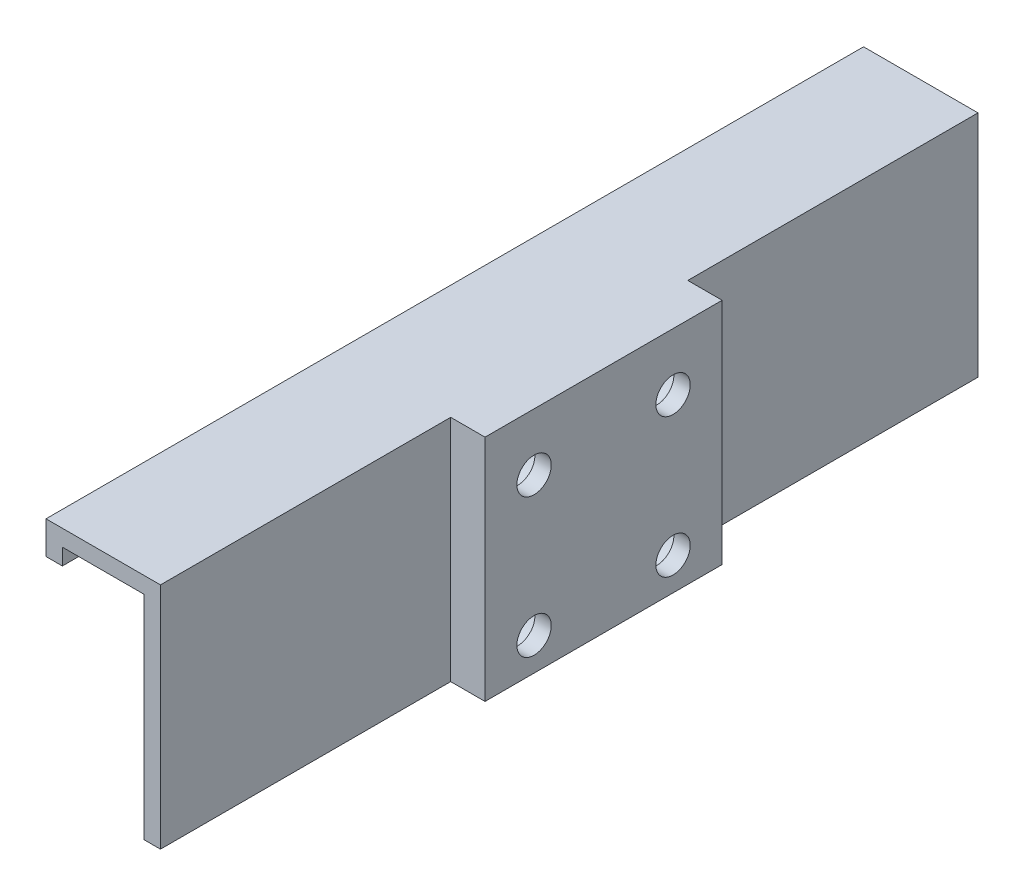
ISO-10303-21;
HEADER;
FILE_DESCRIPTION(('STEP AP214'),'2;1');
FILE_NAME('part.step','',(''),(''),'','','');
FILE_SCHEMA(('AUTOMOTIVE_DESIGN { 1 0 10303 214 1 1 1 1 }'));
ENDSEC;
DATA;
#1=APPLICATION_CONTEXT('core data for automotive mechanical design processes');
#2=APPLICATION_PROTOCOL_DEFINITION('international standard','automotive_design',2000,#1);
#3=PRODUCT_CONTEXT('',#1,'mechanical');
#4=PRODUCT('Part','Part','',(#3));
#5=PRODUCT_RELATED_PRODUCT_CATEGORY('part','',(#4));
#6=PRODUCT_DEFINITION_FORMATION('','',#4);
#7=PRODUCT_DEFINITION_CONTEXT('part definition',#1,'design');
#8=PRODUCT_DEFINITION('design','',#6,#7);
#9=PRODUCT_DEFINITION_SHAPE('','',#8);
#10=(LENGTH_UNIT() NAMED_UNIT(*) SI_UNIT(.MILLI.,.METRE.));
#11=(NAMED_UNIT(*) PLANE_ANGLE_UNIT() SI_UNIT($,.RADIAN.));
#12=(NAMED_UNIT(*) SI_UNIT($,.STERADIAN.) SOLID_ANGLE_UNIT());
#13=UNCERTAINTY_MEASURE_WITH_UNIT(LENGTH_MEASURE(1.E-05),#10,'distance_accuracy_value','');
#14=(GEOMETRIC_REPRESENTATION_CONTEXT(3) GLOBAL_UNCERTAINTY_ASSIGNED_CONTEXT((#13)) GLOBAL_UNIT_ASSIGNED_CONTEXT((#10,
#11,#12)) REPRESENTATION_CONTEXT('',''));
#15=CARTESIAN_POINT('',(0.,0.,0.));
#16=DIRECTION('',(0.,0.,1.));
#17=DIRECTION('',(1.,0.,0.));
#18=AXIS2_PLACEMENT_3D('',#15,#16,#17);
#19=CARTESIAN_POINT('',(-12.,21.,-41.5));
#20=DIRECTION('',(1.,0.,0.));
#21=DIRECTION('',(0.,0.,-1.));
#22=AXIS2_PLACEMENT_3D('',#19,#20,#21);
#23=CYLINDRICAL_SURFACE('',#22,2.1);
#24=CARTESIAN_POINT('',(6.2,21.,-41.5));
#25=DIRECTION('',(1.,0.,0.));
#26=DIRECTION('',(0.,0.,-1.));
#27=AXIS2_PLACEMENT_3D('',#24,#25,#26);
#28=CIRCLE('',#27,2.1);
#29=CARTESIAN_POINT('',(6.2,21.,-43.6));
#30=VERTEX_POINT('',#29);
#31=EDGE_CURVE('E142',#30,#30,#28,.T.);
#32=ORIENTED_EDGE('',*,*,#31,.T.);
#33=EDGE_LOOP('',(#32));
#34=FACE_BOUND('',#33,.T.);
#35=CARTESIAN_POINT('',(4.2,21.,-41.5));
#36=DIRECTION('',(-1.,0.,0.));
#37=DIRECTION('',(0.,0.,1.));
#38=AXIS2_PLACEMENT_3D('',#35,#36,#37);
#39=CIRCLE('',#38,2.1);
#40=CARTESIAN_POINT('',(4.2,21.,-39.4));
#41=VERTEX_POINT('',#40);
#42=EDGE_CURVE('E130',#41,#41,#39,.F.);
#43=ORIENTED_EDGE('',*,*,#42,.F.);
#44=EDGE_LOOP('',(#43));
#45=FACE_BOUND('',#44,.T.);
#46=ADVANCED_FACE('F38',(#34,#45),#23,.F.);
#47=CARTESIAN_POINT('',(-12.,21.,-58.5));
#48=DIRECTION('',(1.,0.,0.));
#49=DIRECTION('',(0.,0.,-1.));
#50=AXIS2_PLACEMENT_3D('',#47,#48,#49);
#51=CYLINDRICAL_SURFACE('',#50,2.1);
#52=CARTESIAN_POINT('',(6.2,21.,-58.5));
#53=DIRECTION('',(1.,0.,0.));
#54=DIRECTION('',(0.,0.,-1.));
#55=AXIS2_PLACEMENT_3D('',#52,#53,#54);
#56=CIRCLE('',#55,2.1);
#57=CARTESIAN_POINT('',(6.2,21.,-60.6));
#58=VERTEX_POINT('',#57);
#59=EDGE_CURVE('E139',#58,#58,#56,.T.);
#60=ORIENTED_EDGE('',*,*,#59,.T.);
#61=EDGE_LOOP('',(#60));
#62=FACE_BOUND('',#61,.T.);
#63=CARTESIAN_POINT('',(4.2,21.,-58.5));
#64=DIRECTION('',(-1.,0.,0.));
#65=DIRECTION('',(0.,0.,1.));
#66=AXIS2_PLACEMENT_3D('',#63,#64,#65);
#67=CIRCLE('',#66,2.1);
#68=CARTESIAN_POINT('',(4.2,21.,-56.4));
#69=VERTEX_POINT('',#68);
#70=EDGE_CURVE('E127',#69,#69,#67,.F.);
#71=ORIENTED_EDGE('',*,*,#70,.F.);
#72=EDGE_LOOP('',(#71));
#73=FACE_BOUND('',#72,.T.);
#74=ADVANCED_FACE('F336',(#62,#73),#51,.F.);
#75=CARTESIAN_POINT('',(-12.,4.,-58.5));
#76=DIRECTION('',(1.,0.,0.));
#77=DIRECTION('',(0.,0.,-1.));
#78=AXIS2_PLACEMENT_3D('',#75,#76,#77);
#79=CYLINDRICAL_SURFACE('',#78,2.1);
#80=CARTESIAN_POINT('',(6.2,4.,-58.5));
#81=DIRECTION('',(1.,0.,0.));
#82=DIRECTION('',(0.,0.,-1.));
#83=AXIS2_PLACEMENT_3D('',#80,#81,#82);
#84=CIRCLE('',#83,2.1);
#85=CARTESIAN_POINT('',(6.2,4.,-60.6));
#86=VERTEX_POINT('',#85);
#87=EDGE_CURVE('E136',#86,#86,#84,.T.);
#88=ORIENTED_EDGE('',*,*,#87,.T.);
#89=EDGE_LOOP('',(#88));
#90=FACE_BOUND('',#89,.T.);
#91=CARTESIAN_POINT('',(4.2,4.,-58.5));
#92=DIRECTION('',(-1.,0.,0.));
#93=DIRECTION('',(0.,0.,1.));
#94=AXIS2_PLACEMENT_3D('',#91,#92,#93);
#95=CIRCLE('',#94,2.1);
#96=CARTESIAN_POINT('',(4.2,4.,-56.4));
#97=VERTEX_POINT('',#96);
#98=EDGE_CURVE('E123',#97,#97,#95,.F.);
#99=ORIENTED_EDGE('',*,*,#98,.F.);
#100=EDGE_LOOP('',(#99));
#101=FACE_BOUND('',#100,.T.);
#102=ADVANCED_FACE('F342',(#90,#101),#79,.F.);
#103=CARTESIAN_POINT('',(-12.,4.,-41.5));
#104=DIRECTION('',(1.,0.,0.));
#105=DIRECTION('',(0.,0.,-1.));
#106=AXIS2_PLACEMENT_3D('',#103,#104,#105);
#107=CYLINDRICAL_SURFACE('',#106,2.1);
#108=CARTESIAN_POINT('',(6.2,4.,-41.5));
#109=DIRECTION('',(1.,0.,0.));
#110=DIRECTION('',(0.,0.,-1.));
#111=AXIS2_PLACEMENT_3D('',#108,#109,#110);
#112=CIRCLE('',#111,2.1);
#113=CARTESIAN_POINT('',(6.2,4.,-43.6));
#114=VERTEX_POINT('',#113);
#115=EDGE_CURVE('E133',#114,#114,#112,.T.);
#116=ORIENTED_EDGE('',*,*,#115,.T.);
#117=EDGE_LOOP('',(#116));
#118=FACE_BOUND('',#117,.T.);
#119=CARTESIAN_POINT('',(4.2,4.,-41.5));
#120=DIRECTION('',(-1.,0.,0.));
#121=DIRECTION('',(0.,0.,1.));
#122=AXIS2_PLACEMENT_3D('',#119,#120,#121);
#123=CIRCLE('',#122,2.1);
#124=CARTESIAN_POINT('',(4.2,4.,-39.4));
#125=VERTEX_POINT('',#124);
#126=EDGE_CURVE('E120',#125,#125,#123,.F.);
#127=ORIENTED_EDGE('',*,*,#126,.F.);
#128=EDGE_LOOP('',(#127));
#129=FACE_BOUND('',#128,.T.);
#130=ADVANCED_FACE('F347',(#118,#129),#107,.F.);
#131=CARTESIAN_POINT('',(2.,0.,0.));
#132=DIRECTION('',(-1.,0.,0.));
#133=DIRECTION('',(0.,0.,1.));
#134=AXIS2_PLACEMENT_3D('',#131,#132,#133);
#135=PLANE('',#134);
#136=DIRECTION('',(0.,-1.,0.));
#137=VECTOR('',#136,1.);
#138=CARTESIAN_POINT('',(2.,0.,-35.5));
#139=LINE('',#138,#137);
#140=CARTESIAN_POINT('',(2.,28.,-35.5));
#141=VERTEX_POINT('',#140);
#142=CARTESIAN_POINT('',(2.,0.,-35.5));
#143=VERTEX_POINT('',#142);
#144=EDGE_CURVE('E57',#141,#143,#139,.T.);
#145=ORIENTED_EDGE('',*,*,#144,.F.);
#146=DIRECTION('',(0.,0.,1.));
#147=VECTOR('',#146,1.);
#148=CARTESIAN_POINT('',(2.,28.,-114.560219778561));
#149=LINE('',#148,#147);
#150=CARTESIAN_POINT('',(2.,28.,0.));
#151=VERTEX_POINT('',#150);
#152=EDGE_CURVE('E153',#141,#151,#149,.T.);
#153=ORIENTED_EDGE('',*,*,#152,.T.);
#154=DIRECTION('',(0.,-1.,0.));
#155=VECTOR('',#154,1.);
#156=CARTESIAN_POINT('',(2.,0.,0.));
#157=LINE('',#156,#155);
#158=CARTESIAN_POINT('',(2.,0.,0.));
#159=VERTEX_POINT('',#158);
#160=EDGE_CURVE('E168',#151,#159,#157,.T.);
#161=ORIENTED_EDGE('',*,*,#160,.T.);
#162=DIRECTION('',(0.,0.,-1.));
#163=VECTOR('',#162,1.);
#164=CARTESIAN_POINT('',(2.,0.,0.));
#165=LINE('',#164,#163);
#166=EDGE_CURVE('E172',#159,#143,#165,.T.);
#167=ORIENTED_EDGE('',*,*,#166,.T.);
#168=EDGE_LOOP('',(#145,#153,#161,#167));
#169=FACE_BOUND('',#168,.T.);
#170=ADVANCED_FACE('F248',(#169),#135,.F.);
#171=DIRECTION('',(0.,1.,0.));
#172=VECTOR('',#171,1.);
#173=CARTESIAN_POINT('',(2.,0.,-64.5));
#174=LINE('',#173,#172);
#175=CARTESIAN_POINT('',(2.,0.,-64.5));
#176=VERTEX_POINT('',#175);
#177=CARTESIAN_POINT('',(2.,28.,-64.5));
#178=VERTEX_POINT('',#177);
#179=EDGE_CURVE('E102',#176,#178,#174,.T.);
#180=ORIENTED_EDGE('',*,*,#179,.F.);
#181=CARTESIAN_POINT('',(2.,0.,-100.));
#182=VERTEX_POINT('',#181);
#183=EDGE_CURVE('E170',#176,#182,#165,.T.);
#184=ORIENTED_EDGE('',*,*,#183,.T.);
#185=DIRECTION('',(0.,1.,0.));
#186=VECTOR('',#185,1.);
#187=CARTESIAN_POINT('',(2.,0.,-100.));
#188=LINE('',#187,#186);
#189=CARTESIAN_POINT('',(2.,28.,-100.));
#190=VERTEX_POINT('',#189);
#191=EDGE_CURVE('E174',#182,#190,#188,.T.);
#192=ORIENTED_EDGE('',*,*,#191,.T.);
#193=EDGE_CURVE('E158',#190,#178,#149,.T.);
#194=ORIENTED_EDGE('',*,*,#193,.T.);
#195=EDGE_LOOP('',(#180,#184,#192,#194));
#196=FACE_BOUND('',#195,.T.);
#197=ADVANCED_FACE('F360',(#196),#135,.F.);
#198=CARTESIAN_POINT('',(2.,0.,0.));
#199=DIRECTION('',(0.,0.,-1.));
#200=DIRECTION('',(-1.,0.,0.));
#201=AXIS2_PLACEMENT_3D('',#198,#199,#200);
#202=PLANE('',#201);
#203=DIRECTION('',(0.,-1.,0.));
#204=VECTOR('',#203,1.);
#205=CARTESIAN_POINT('',(0.,0.,0.));
#206=LINE('',#205,#204);
#207=CARTESIAN_POINT('',(0.,26.,0.));
#208=VERTEX_POINT('',#207);
#209=CARTESIAN_POINT('',(0.,0.,0.));
#210=VERTEX_POINT('',#209);
#211=EDGE_CURVE('E177',#208,#210,#206,.T.);
#212=ORIENTED_EDGE('',*,*,#211,.T.);
#213=DIRECTION('',(-1.,0.,0.));
#214=VECTOR('',#213,1.);
#215=CARTESIAN_POINT('',(2.,0.,0.));
#216=LINE('',#215,#214);
#217=EDGE_CURVE('E12',#159,#210,#216,.T.);
#218=ORIENTED_EDGE('',*,*,#217,.F.);
#219=ORIENTED_EDGE('',*,*,#160,.F.);
#220=DIRECTION('',(-1.,0.,0.));
#221=VECTOR('',#220,1.);
#222=CARTESIAN_POINT('',(2.,28.,0.));
#223=LINE('',#222,#221);
#224=CARTESIAN_POINT('',(-12.,28.,0.));
#225=VERTEX_POINT('',#224);
#226=EDGE_CURVE('E108',#151,#225,#223,.T.);
#227=ORIENTED_EDGE('',*,*,#226,.T.);
#228=DIRECTION('',(0.,-1.,0.));
#229=VECTOR('',#228,1.);
#230=CARTESIAN_POINT('',(-12.,28.,0.));
#231=LINE('',#230,#229);
#232=CARTESIAN_POINT('',(-12.,24.,0.));
#233=VERTEX_POINT('',#232);
#234=EDGE_CURVE('E222',#225,#233,#231,.T.);
#235=ORIENTED_EDGE('',*,*,#234,.T.);
#236=DIRECTION('',(1.,0.,0.));
#237=VECTOR('',#236,1.);
#238=CARTESIAN_POINT('',(-12.,24.,0.));
#239=LINE('',#238,#237);
#240=CARTESIAN_POINT('',(-10.,24.,0.));
#241=VERTEX_POINT('',#240);
#242=EDGE_CURVE('E163',#233,#241,#239,.T.);
#243=ORIENTED_EDGE('',*,*,#242,.T.);
#244=DIRECTION('',(0.,1.,0.));
#245=VECTOR('',#244,1.);
#246=CARTESIAN_POINT('',(-10.,24.,0.));
#247=LINE('',#246,#245);
#248=CARTESIAN_POINT('',(-10.,26.,0.));
#249=VERTEX_POINT('',#248);
#250=EDGE_CURVE('E159',#241,#249,#247,.T.);
#251=ORIENTED_EDGE('',*,*,#250,.T.);
#252=DIRECTION('',(1.,0.,0.));
#253=VECTOR('',#252,1.);
#254=CARTESIAN_POINT('',(-10.,26.,0.));
#255=LINE('',#254,#253);
#256=EDGE_CURVE('E105',#249,#208,#255,.T.);
#257=ORIENTED_EDGE('',*,*,#256,.T.);
#258=EDGE_LOOP('',(#212,#218,#219,#227,#235,#243,#251,#257));
#259=FACE_BOUND('',#258,.T.);
#260=ADVANCED_FACE('F245',(#259),#202,.F.);
#261=CARTESIAN_POINT('',(2.,0.,0.));
#262=DIRECTION('',(0.,1.,0.));
#263=DIRECTION('',(0.,0.,1.));
#264=AXIS2_PLACEMENT_3D('',#261,#262,#263);
#265=PLANE('',#264);
#266=DIRECTION('',(0.,0.,-1.));
#267=VECTOR('',#266,1.);
#268=CARTESIAN_POINT('',(0.,0.,0.));
#269=LINE('',#268,#267);
#270=CARTESIAN_POINT('',(0.,0.,-100.));
#271=VERTEX_POINT('',#270);
#272=EDGE_CURVE('E180',#210,#271,#269,.T.);
#273=ORIENTED_EDGE('',*,*,#272,.T.);
#274=DIRECTION('',(-1.,0.,0.));
#275=VECTOR('',#274,1.);
#276=CARTESIAN_POINT('',(2.,0.,-100.));
#277=LINE('',#276,#275);
#278=EDGE_CURVE('E48',#182,#271,#277,.T.);
#279=ORIENTED_EDGE('',*,*,#278,.F.);
#280=ORIENTED_EDGE('',*,*,#183,.F.);
#281=DIRECTION('',(-1.,0.,0.));
#282=VECTOR('',#281,1.);
#283=CARTESIAN_POINT('',(6.,0.,-64.5));
#284=LINE('',#283,#282);
#285=CARTESIAN_POINT('',(6.2,0.,-64.5));
#286=VERTEX_POINT('',#285);
#287=EDGE_CURVE('E92',#286,#176,#284,.T.);
#288=ORIENTED_EDGE('',*,*,#287,.F.);
#289=DIRECTION('',(0.,0.,-1.));
#290=VECTOR('',#289,1.);
#291=CARTESIAN_POINT('',(6.2,0.,0.));
#292=LINE('',#291,#290);
#293=CARTESIAN_POINT('',(6.2,0.,-35.5));
#294=VERTEX_POINT('',#293);
#295=EDGE_CURVE('E42',#294,#286,#292,.T.);
#296=ORIENTED_EDGE('',*,*,#295,.F.);
#297=DIRECTION('',(-1.,0.,0.));
#298=VECTOR('',#297,1.);
#299=CARTESIAN_POINT('',(2.,0.,-35.5));
#300=LINE('',#299,#298);
#301=EDGE_CURVE('E89',#294,#143,#300,.T.);
#302=ORIENTED_EDGE('',*,*,#301,.T.);
#303=ORIENTED_EDGE('',*,*,#166,.F.);
#304=ORIENTED_EDGE('',*,*,#217,.T.);
#305=EDGE_LOOP('',(#273,#279,#280,#288,#296,#302,#303,#304));
#306=FACE_BOUND('',#305,.T.);
#307=ADVANCED_FACE('F86',(#306),#265,.F.);
#308=CARTESIAN_POINT('',(2.,0.,-100.));
#309=DIRECTION('',(0.,0.,1.));
#310=DIRECTION('',(1.,0.,0.));
#311=AXIS2_PLACEMENT_3D('',#308,#309,#310);
#312=PLANE('',#311);
#313=DIRECTION('',(0.,1.,0.));
#314=VECTOR('',#313,1.);
#315=CARTESIAN_POINT('',(0.,0.,-100.));
#316=LINE('',#315,#314);
#317=CARTESIAN_POINT('',(0.,26.,-100.));
#318=VERTEX_POINT('',#317);
#319=EDGE_CURVE('E183',#271,#318,#316,.T.);
#320=ORIENTED_EDGE('',*,*,#319,.T.);
#321=DIRECTION('',(-1.,0.,0.));
#322=VECTOR('',#321,1.);
#323=CARTESIAN_POINT('',(-10.,26.,-100.));
#324=LINE('',#323,#322);
#325=CARTESIAN_POINT('',(-10.,26.,-100.));
#326=VERTEX_POINT('',#325);
#327=EDGE_CURVE('E181',#318,#326,#324,.T.);
#328=ORIENTED_EDGE('',*,*,#327,.T.);
#329=DIRECTION('',(0.,-1.,0.));
#330=VECTOR('',#329,1.);
#331=CARTESIAN_POINT('',(-10.,24.,-100.));
#332=LINE('',#331,#330);
#333=CARTESIAN_POINT('',(-10.,24.,-100.));
#334=VERTEX_POINT('',#333);
#335=EDGE_CURVE('E215',#326,#334,#332,.T.);
#336=ORIENTED_EDGE('',*,*,#335,.T.);
#337=DIRECTION('',(-1.,0.,0.));
#338=VECTOR('',#337,1.);
#339=CARTESIAN_POINT('',(-12.,24.,-100.));
#340=LINE('',#339,#338);
#341=CARTESIAN_POINT('',(-12.,24.,-100.));
#342=VERTEX_POINT('',#341);
#343=EDGE_CURVE('E217',#334,#342,#340,.T.);
#344=ORIENTED_EDGE('',*,*,#343,.T.);
#345=DIRECTION('',(0.,1.,0.));
#346=VECTOR('',#345,1.);
#347=CARTESIAN_POINT('',(-12.,28.,-100.));
#348=LINE('',#347,#346);
#349=CARTESIAN_POINT('',(-12.,28.,-100.));
#350=VERTEX_POINT('',#349);
#351=EDGE_CURVE('E259',#342,#350,#348,.T.);
#352=ORIENTED_EDGE('',*,*,#351,.T.);
#353=DIRECTION('',(1.,0.,0.));
#354=VECTOR('',#353,1.);
#355=CARTESIAN_POINT('',(2.,28.,-100.));
#356=LINE('',#355,#354);
#357=EDGE_CURVE('E228',#350,#190,#356,.T.);
#358=ORIENTED_EDGE('',*,*,#357,.T.);
#359=ORIENTED_EDGE('',*,*,#191,.F.);
#360=ORIENTED_EDGE('',*,*,#278,.T.);
#361=EDGE_LOOP('',(#320,#328,#336,#344,#352,#358,#359,#360));
#362=FACE_BOUND('',#361,.T.);
#363=ADVANCED_FACE('F194',(#362),#312,.F.);
#364=CARTESIAN_POINT('',(0.,0.,0.));
#365=DIRECTION('',(-1.,0.,0.));
#366=DIRECTION('',(0.,0.,1.));
#367=AXIS2_PLACEMENT_3D('',#364,#365,#366);
#368=PLANE('',#367);
#369=CARTESIAN_POINT('',(0.,4.,-58.5));
#370=DIRECTION('',(-1.,0.,0.));
#371=DIRECTION('',(0.,0.,1.));
#372=AXIS2_PLACEMENT_3D('',#369,#370,#371);
#373=CIRCLE('',#372,3.6);
#374=CARTESIAN_POINT('',(0.,4.,-54.9));
#375=VERTEX_POINT('',#374);
#376=EDGE_CURVE('E287',#375,#375,#373,.T.);
#377=ORIENTED_EDGE('',*,*,#376,.F.);
#378=EDGE_LOOP('',(#377));
#379=FACE_BOUND('',#378,.T.);
#380=CARTESIAN_POINT('',(0.,4.,-41.5));
#381=DIRECTION('',(-1.,0.,0.));
#382=DIRECTION('',(0.,0.,1.));
#383=AXIS2_PLACEMENT_3D('',#380,#381,#382);
#384=CIRCLE('',#383,3.6);
#385=CARTESIAN_POINT('',(0.,4.,-37.9));
#386=VERTEX_POINT('',#385);
#387=EDGE_CURVE('E293',#386,#386,#384,.T.);
#388=ORIENTED_EDGE('',*,*,#387,.F.);
#389=EDGE_LOOP('',(#388));
#390=FACE_BOUND('',#389,.T.);
#391=CARTESIAN_POINT('',(0.,21.,-41.5));
#392=DIRECTION('',(-1.,0.,0.));
#393=DIRECTION('',(0.,0.,1.));
#394=AXIS2_PLACEMENT_3D('',#391,#392,#393);
#395=CIRCLE('',#394,3.6);
#396=CARTESIAN_POINT('',(0.,21.,-37.9));
#397=VERTEX_POINT('',#396);
#398=EDGE_CURVE('E299',#397,#397,#395,.T.);
#399=ORIENTED_EDGE('',*,*,#398,.F.);
#400=EDGE_LOOP('',(#399));
#401=FACE_BOUND('',#400,.T.);
#402=CARTESIAN_POINT('',(0.,21.,-58.5));
#403=DIRECTION('',(-1.,0.,0.));
#404=DIRECTION('',(0.,0.,1.));
#405=AXIS2_PLACEMENT_3D('',#402,#403,#404);
#406=CIRCLE('',#405,3.6);
#407=CARTESIAN_POINT('',(0.,21.,-54.9));
#408=VERTEX_POINT('',#407);
#409=EDGE_CURVE('E281',#408,#408,#406,.T.);
#410=ORIENTED_EDGE('',*,*,#409,.F.);
#411=EDGE_LOOP('',(#410));
#412=FACE_BOUND('',#411,.T.);
#413=ORIENTED_EDGE('',*,*,#211,.F.);
#414=DIRECTION('',(0.,0.,1.));
#415=VECTOR('',#414,1.);
#416=CARTESIAN_POINT('',(0.,26.,0.));
#417=LINE('',#416,#415);
#418=EDGE_CURVE('E171',#318,#208,#417,.T.);
#419=ORIENTED_EDGE('',*,*,#418,.F.);
#420=ORIENTED_EDGE('',*,*,#319,.F.);
#421=ORIENTED_EDGE('',*,*,#272,.F.);
#422=EDGE_LOOP('',(#413,#419,#420,#421));
#423=FACE_BOUND('',#422,.T.);
#424=ADVANCED_FACE('F202',(#379,#390,#401,#412,#423),#368,.T.);
#425=CARTESIAN_POINT('',(-10.,26.,-114.560219778561));
#426=DIRECTION('',(0.,-1.,0.));
#427=DIRECTION('',(0.,0.,-1.));
#428=AXIS2_PLACEMENT_3D('',#425,#426,#427);
#429=PLANE('',#428);
#430=ORIENTED_EDGE('',*,*,#327,.F.);
#431=ORIENTED_EDGE('',*,*,#418,.T.);
#432=ORIENTED_EDGE('',*,*,#256,.F.);
#433=DIRECTION('',(0.,0.,1.));
#434=VECTOR('',#433,1.);
#435=CARTESIAN_POINT('',(-10.,26.,-114.560219778561));
#436=LINE('',#435,#434);
#437=EDGE_CURVE('E212',#326,#249,#436,.T.);
#438=ORIENTED_EDGE('',*,*,#437,.F.);
#439=EDGE_LOOP('',(#430,#431,#432,#438));
#440=FACE_BOUND('',#439,.T.);
#441=ADVANCED_FACE('F209',(#440),#429,.T.);
#442=CARTESIAN_POINT('',(-10.,24.,-114.560219778561));
#443=DIRECTION('',(1.,0.,0.));
#444=DIRECTION('',(0.,1.,0.));
#445=AXIS2_PLACEMENT_3D('',#442,#443,#444);
#446=PLANE('',#445);
#447=ORIENTED_EDGE('',*,*,#335,.F.);
#448=ORIENTED_EDGE('',*,*,#437,.T.);
#449=ORIENTED_EDGE('',*,*,#250,.F.);
#450=DIRECTION('',(0.,0.,1.));
#451=VECTOR('',#450,1.);
#452=CARTESIAN_POINT('',(-10.,24.,-114.560219778561));
#453=LINE('',#452,#451);
#454=EDGE_CURVE('E229',#334,#241,#453,.T.);
#455=ORIENTED_EDGE('',*,*,#454,.F.);
#456=EDGE_LOOP('',(#447,#448,#449,#455));
#457=FACE_BOUND('',#456,.T.);
#458=ADVANCED_FACE('F277',(#457),#446,.T.);
#459=CARTESIAN_POINT('',(-12.,24.,-114.560219778561));
#460=DIRECTION('',(0.,-1.,0.));
#461=DIRECTION('',(0.,0.,-1.));
#462=AXIS2_PLACEMENT_3D('',#459,#460,#461);
#463=PLANE('',#462);
#464=ORIENTED_EDGE('',*,*,#343,.F.);
#465=ORIENTED_EDGE('',*,*,#454,.T.);
#466=ORIENTED_EDGE('',*,*,#242,.F.);
#467=DIRECTION('',(0.,0.,1.));
#468=VECTOR('',#467,1.);
#469=CARTESIAN_POINT('',(-12.,24.,-114.560219778561));
#470=LINE('',#469,#468);
#471=EDGE_CURVE('E231',#342,#233,#470,.T.);
#472=ORIENTED_EDGE('',*,*,#471,.F.);
#473=EDGE_LOOP('',(#464,#465,#466,#472));
#474=FACE_BOUND('',#473,.T.);
#475=ADVANCED_FACE('F274',(#474),#463,.T.);
#476=CARTESIAN_POINT('',(-12.,28.,-114.560219778561));
#477=DIRECTION('',(-1.,0.,0.));
#478=DIRECTION('',(0.,0.,1.));
#479=AXIS2_PLACEMENT_3D('',#476,#477,#478);
#480=PLANE('',#479);
#481=ORIENTED_EDGE('',*,*,#351,.F.);
#482=ORIENTED_EDGE('',*,*,#471,.T.);
#483=ORIENTED_EDGE('',*,*,#234,.F.);
#484=DIRECTION('',(0.,0.,1.));
#485=VECTOR('',#484,1.);
#486=CARTESIAN_POINT('',(-12.,28.,-114.560219778561));
#487=LINE('',#486,#485);
#488=EDGE_CURVE('E161',#350,#225,#487,.T.);
#489=ORIENTED_EDGE('',*,*,#488,.F.);
#490=EDGE_LOOP('',(#481,#482,#483,#489));
#491=FACE_BOUND('',#490,.T.);
#492=ADVANCED_FACE('F243',(#491),#480,.T.);
#493=CARTESIAN_POINT('',(2.,28.,-114.560219778561));
#494=DIRECTION('',(0.,1.,0.));
#495=DIRECTION('',(0.,0.,1.));
#496=AXIS2_PLACEMENT_3D('',#493,#494,#495);
#497=PLANE('',#496);
#498=ORIENTED_EDGE('',*,*,#357,.F.);
#499=ORIENTED_EDGE('',*,*,#488,.T.);
#500=ORIENTED_EDGE('',*,*,#226,.F.);
#501=ORIENTED_EDGE('',*,*,#152,.F.);
#502=DIRECTION('',(-1.,0.,0.));
#503=VECTOR('',#502,1.);
#504=CARTESIAN_POINT('',(2.,28.,-35.5));
#505=LINE('',#504,#503);
#506=CARTESIAN_POINT('',(6.2,28.,-35.5));
#507=VERTEX_POINT('',#506);
#508=EDGE_CURVE('E114',#507,#141,#505,.T.);
#509=ORIENTED_EDGE('',*,*,#508,.F.);
#510=DIRECTION('',(0.,0.,1.));
#511=VECTOR('',#510,1.);
#512=CARTESIAN_POINT('',(6.2,28.,0.));
#513=LINE('',#512,#511);
#514=CARTESIAN_POINT('',(6.2,28.,-64.5));
#515=VERTEX_POINT('',#514);
#516=EDGE_CURVE('E98',#515,#507,#513,.T.);
#517=ORIENTED_EDGE('',*,*,#516,.F.);
#518=DIRECTION('',(-1.,0.,0.));
#519=VECTOR('',#518,1.);
#520=CARTESIAN_POINT('',(6.,28.,-64.5));
#521=LINE('',#520,#519);
#522=EDGE_CURVE('E110',#515,#178,#521,.T.);
#523=ORIENTED_EDGE('',*,*,#522,.T.);
#524=ORIENTED_EDGE('',*,*,#193,.F.);
#525=EDGE_LOOP('',(#498,#499,#500,#501,#509,#517,#523,#524));
#526=FACE_BOUND('',#525,.T.);
#527=ADVANCED_FACE('F151',(#526),#497,.T.);
#528=CARTESIAN_POINT('',(6.,28.,-35.5));
#529=DIRECTION('',(0.,0.,-1.));
#530=DIRECTION('',(-1.,0.,0.));
#531=AXIS2_PLACEMENT_3D('',#528,#529,#530);
#532=PLANE('',#531);
#533=ORIENTED_EDGE('',*,*,#144,.T.);
#534=ORIENTED_EDGE('',*,*,#301,.F.);
#535=DIRECTION('',(0.,-1.,0.));
#536=VECTOR('',#535,1.);
#537=CARTESIAN_POINT('',(6.2,28.,-35.5));
#538=LINE('',#537,#536);
#539=EDGE_CURVE('E95',#507,#294,#538,.T.);
#540=ORIENTED_EDGE('',*,*,#539,.F.);
#541=ORIENTED_EDGE('',*,*,#508,.T.);
#542=EDGE_LOOP('',(#533,#534,#540,#541));
#543=FACE_BOUND('',#542,.T.);
#544=ADVANCED_FACE('F104',(#543),#532,.F.);
#545=CARTESIAN_POINT('',(6.,28.,-64.5));
#546=DIRECTION('',(0.,0.,1.));
#547=DIRECTION('',(1.,0.,0.));
#548=AXIS2_PLACEMENT_3D('',#545,#546,#547);
#549=PLANE('',#548);
#550=ORIENTED_EDGE('',*,*,#179,.T.);
#551=ORIENTED_EDGE('',*,*,#522,.F.);
#552=DIRECTION('',(0.,1.,0.));
#553=VECTOR('',#552,1.);
#554=CARTESIAN_POINT('',(6.2,28.,-64.5));
#555=LINE('',#554,#553);
#556=EDGE_CURVE('E94',#286,#515,#555,.T.);
#557=ORIENTED_EDGE('',*,*,#556,.F.);
#558=ORIENTED_EDGE('',*,*,#287,.T.);
#559=EDGE_LOOP('',(#550,#551,#557,#558));
#560=FACE_BOUND('',#559,.T.);
#561=ADVANCED_FACE('F147',(#560),#549,.F.);
#562=CARTESIAN_POINT('',(6.2,0.,0.));
#563=DIRECTION('',(1.,0.,0.));
#564=DIRECTION('',(0.,0.,-1.));
#565=AXIS2_PLACEMENT_3D('',#562,#563,#564);
#566=PLANE('',#565);
#567=ORIENTED_EDGE('',*,*,#115,.F.);
#568=EDGE_LOOP('',(#567));
#569=FACE_BOUND('',#568,.T.);
#570=ORIENTED_EDGE('',*,*,#87,.F.);
#571=EDGE_LOOP('',(#570));
#572=FACE_BOUND('',#571,.T.);
#573=ORIENTED_EDGE('',*,*,#59,.F.);
#574=EDGE_LOOP('',(#573));
#575=FACE_BOUND('',#574,.T.);
#576=ORIENTED_EDGE('',*,*,#31,.F.);
#577=EDGE_LOOP('',(#576));
#578=FACE_BOUND('',#577,.T.);
#579=ORIENTED_EDGE('',*,*,#539,.T.);
#580=ORIENTED_EDGE('',*,*,#295,.T.);
#581=ORIENTED_EDGE('',*,*,#556,.T.);
#582=ORIENTED_EDGE('',*,*,#516,.T.);
#583=EDGE_LOOP('',(#579,#580,#581,#582));
#584=FACE_BOUND('',#583,.T.);
#585=ADVANCED_FACE('F40',(#569,#572,#575,#578,#584),#566,.T.);
#586=CARTESIAN_POINT('',(4.2,4.,-41.5));
#587=DIRECTION('',(-1.,0.,0.));
#588=DIRECTION('',(0.,0.,1.));
#589=AXIS2_PLACEMENT_3D('',#586,#587,#588);
#590=PLANE('',#589);
#591=CARTESIAN_POINT('',(4.2,4.,-41.5));
#592=DIRECTION('',(-1.,0.,0.));
#593=DIRECTION('',(0.,0.,1.));
#594=AXIS2_PLACEMENT_3D('',#591,#592,#593);
#595=CIRCLE('',#594,3.6);
#596=CARTESIAN_POINT('',(4.2,4.,-37.9));
#597=VERTEX_POINT('',#596);
#598=EDGE_CURVE('E296',#597,#597,#595,.T.);
#599=ORIENTED_EDGE('',*,*,#598,.T.);
#600=EDGE_LOOP('',(#599));
#601=FACE_BOUND('',#600,.T.);
#602=ORIENTED_EDGE('',*,*,#126,.T.);
#603=EDGE_LOOP('',(#602));
#604=FACE_BOUND('',#603,.T.);
#605=ADVANCED_FACE('F373',(#601,#604),#590,.T.);
#606=CARTESIAN_POINT('',(4.2,4.,-41.5));
#607=DIRECTION('',(-1.,0.,0.));
#608=DIRECTION('',(0.,0.,1.));
#609=AXIS2_PLACEMENT_3D('',#606,#607,#608);
#610=CYLINDRICAL_SURFACE('',#609,3.6);
#611=ORIENTED_EDGE('',*,*,#598,.F.);
#612=EDGE_LOOP('',(#611));
#613=FACE_BOUND('',#612,.T.);
#614=ORIENTED_EDGE('',*,*,#387,.T.);
#615=EDGE_LOOP('',(#614));
#616=FACE_BOUND('',#615,.T.);
#617=ADVANCED_FACE('F378',(#613,#616),#610,.F.);
#618=CARTESIAN_POINT('',(4.2,4.,-58.5));
#619=DIRECTION('',(-1.,0.,0.));
#620=DIRECTION('',(0.,0.,1.));
#621=AXIS2_PLACEMENT_3D('',#618,#619,#620);
#622=PLANE('',#621);
#623=CARTESIAN_POINT('',(4.2,4.,-58.5));
#624=DIRECTION('',(-1.,0.,0.));
#625=DIRECTION('',(0.,0.,1.));
#626=AXIS2_PLACEMENT_3D('',#623,#624,#625);
#627=CIRCLE('',#626,3.6);
#628=CARTESIAN_POINT('',(4.2,4.,-54.9));
#629=VERTEX_POINT('',#628);
#630=EDGE_CURVE('E290',#629,#629,#627,.T.);
#631=ORIENTED_EDGE('',*,*,#630,.T.);
#632=EDGE_LOOP('',(#631));
#633=FACE_BOUND('',#632,.T.);
#634=ORIENTED_EDGE('',*,*,#98,.T.);
#635=EDGE_LOOP('',(#634));
#636=FACE_BOUND('',#635,.T.);
#637=ADVANCED_FACE('F396',(#633,#636),#622,.T.);
#638=CARTESIAN_POINT('',(4.2,4.,-58.5));
#639=DIRECTION('',(-1.,0.,0.));
#640=DIRECTION('',(0.,0.,1.));
#641=AXIS2_PLACEMENT_3D('',#638,#639,#640);
#642=CYLINDRICAL_SURFACE('',#641,3.6);
#643=ORIENTED_EDGE('',*,*,#630,.F.);
#644=EDGE_LOOP('',(#643));
#645=FACE_BOUND('',#644,.T.);
#646=ORIENTED_EDGE('',*,*,#376,.T.);
#647=EDGE_LOOP('',(#646));
#648=FACE_BOUND('',#647,.T.);
#649=ADVANCED_FACE('F330',(#645,#648),#642,.F.);
#650=CARTESIAN_POINT('',(4.2,21.,-58.5));
#651=DIRECTION('',(-1.,0.,0.));
#652=DIRECTION('',(0.,0.,1.));
#653=AXIS2_PLACEMENT_3D('',#650,#651,#652);
#654=PLANE('',#653);
#655=CARTESIAN_POINT('',(4.2,21.,-58.5));
#656=DIRECTION('',(-1.,0.,0.));
#657=DIRECTION('',(0.,0.,1.));
#658=AXIS2_PLACEMENT_3D('',#655,#656,#657);
#659=CIRCLE('',#658,3.6);
#660=CARTESIAN_POINT('',(4.2,21.,-54.9));
#661=VERTEX_POINT('',#660);
#662=EDGE_CURVE('E124',#661,#661,#659,.T.);
#663=ORIENTED_EDGE('',*,*,#662,.T.);
#664=EDGE_LOOP('',(#663));
#665=FACE_BOUND('',#664,.T.);
#666=ORIENTED_EDGE('',*,*,#70,.T.);
#667=EDGE_LOOP('',(#666));
#668=FACE_BOUND('',#667,.T.);
#669=ADVANCED_FACE('F322',(#665,#668),#654,.T.);
#670=CARTESIAN_POINT('',(4.2,21.,-58.5));
#671=DIRECTION('',(-1.,0.,0.));
#672=DIRECTION('',(0.,0.,1.));
#673=AXIS2_PLACEMENT_3D('',#670,#671,#672);
#674=CYLINDRICAL_SURFACE('',#673,3.6);
#675=ORIENTED_EDGE('',*,*,#662,.F.);
#676=EDGE_LOOP('',(#675));
#677=FACE_BOUND('',#676,.T.);
#678=ORIENTED_EDGE('',*,*,#409,.T.);
#679=EDGE_LOOP('',(#678));
#680=FACE_BOUND('',#679,.T.);
#681=ADVANCED_FACE('F320',(#677,#680),#674,.F.);
#682=CARTESIAN_POINT('',(4.2,21.,-41.5));
#683=DIRECTION('',(-1.,0.,0.));
#684=DIRECTION('',(0.,0.,1.));
#685=AXIS2_PLACEMENT_3D('',#682,#683,#684);
#686=PLANE('',#685);
#687=CARTESIAN_POINT('',(4.2,21.,-41.5));
#688=DIRECTION('',(-1.,0.,0.));
#689=DIRECTION('',(0.,0.,1.));
#690=AXIS2_PLACEMENT_3D('',#687,#688,#689);
#691=CIRCLE('',#690,3.6);
#692=CARTESIAN_POINT('',(4.2,21.,-37.9));
#693=VERTEX_POINT('',#692);
#694=EDGE_CURVE('E284',#693,#693,#691,.T.);
#695=ORIENTED_EDGE('',*,*,#694,.T.);
#696=EDGE_LOOP('',(#695));
#697=FACE_BOUND('',#696,.T.);
#698=ORIENTED_EDGE('',*,*,#42,.T.);
#699=EDGE_LOOP('',(#698));
#700=FACE_BOUND('',#699,.T.);
#701=ADVANCED_FACE('F305',(#697,#700),#686,.T.);
#702=CARTESIAN_POINT('',(4.2,21.,-41.5));
#703=DIRECTION('',(-1.,0.,0.));
#704=DIRECTION('',(0.,0.,1.));
#705=AXIS2_PLACEMENT_3D('',#702,#703,#704);
#706=CYLINDRICAL_SURFACE('',#705,3.6);
#707=ORIENTED_EDGE('',*,*,#694,.F.);
#708=EDGE_LOOP('',(#707));
#709=FACE_BOUND('',#708,.T.);
#710=ORIENTED_EDGE('',*,*,#398,.T.);
#711=EDGE_LOOP('',(#710));
#712=FACE_BOUND('',#711,.T.);
#713=ADVANCED_FACE('F308',(#709,#712),#706,.F.);
#714=CLOSED_SHELL('',(#46,#74,#102,#130,#170,#197,#260,#307,#363,#424,#441,#458,#475,#492,#527,
#544,#561,#585,#605,#617,#637,#649,#669,#681,#701,#713));
#715=MANIFOLD_SOLID_BREP('B2',#714);
#716=ADVANCED_BREP_SHAPE_REPRESENTATION('',(#18,#715),#14);
#717=SHAPE_DEFINITION_REPRESENTATION(#9,#716);
ENDSEC;
END-ISO-10303-21;
